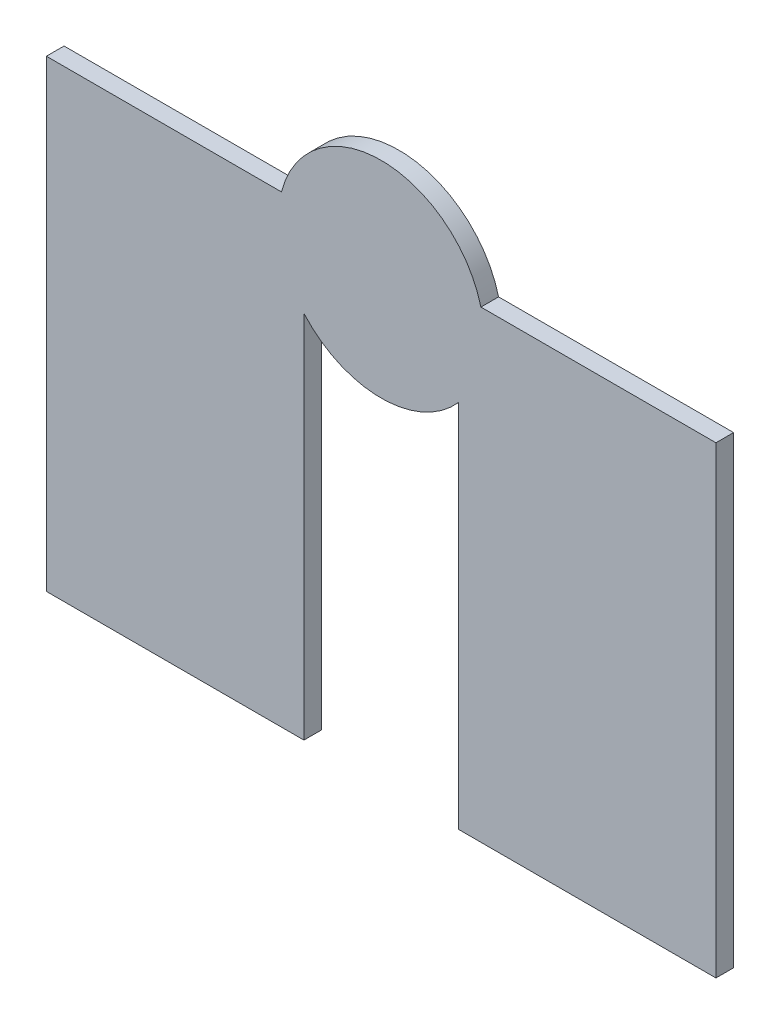
ISO-10303-21;
HEADER;
FILE_DESCRIPTION(('STEP AP214'),'2;1');
FILE_NAME('part.step','',(''),(''),'','','');
FILE_SCHEMA(('AUTOMOTIVE_DESIGN { 1 0 10303 214 1 1 1 1 }'));
ENDSEC;
DATA;
#1=APPLICATION_CONTEXT('core data for automotive mechanical design processes');
#2=APPLICATION_PROTOCOL_DEFINITION('international standard','automotive_design',2000,#1);
#3=PRODUCT_CONTEXT('',#1,'mechanical');
#4=PRODUCT('Part','Part','',(#3));
#5=PRODUCT_RELATED_PRODUCT_CATEGORY('part','',(#4));
#6=PRODUCT_DEFINITION_FORMATION('','',#4);
#7=PRODUCT_DEFINITION_CONTEXT('part definition',#1,'design');
#8=PRODUCT_DEFINITION('design','',#6,#7);
#9=PRODUCT_DEFINITION_SHAPE('','',#8);
#10=(LENGTH_UNIT() NAMED_UNIT(*) SI_UNIT(.MILLI.,.METRE.));
#11=(NAMED_UNIT(*) PLANE_ANGLE_UNIT() SI_UNIT($,.RADIAN.));
#12=(NAMED_UNIT(*) SI_UNIT($,.STERADIAN.) SOLID_ANGLE_UNIT());
#13=UNCERTAINTY_MEASURE_WITH_UNIT(LENGTH_MEASURE(1.E-05),#10,'distance_accuracy_value','');
#14=(GEOMETRIC_REPRESENTATION_CONTEXT(3) GLOBAL_UNCERTAINTY_ASSIGNED_CONTEXT((#13)) GLOBAL_UNIT_ASSIGNED_CONTEXT((#10,
#11,#12)) REPRESENTATION_CONTEXT('',''));
#15=CARTESIAN_POINT('',(0.,0.,0.));
#16=DIRECTION('',(0.,0.,1.));
#17=DIRECTION('',(1.,0.,0.));
#18=AXIS2_PLACEMENT_3D('',#15,#16,#17);
#19=CARTESIAN_POINT('',(9.400080000091,10.531653178882,0.));
#20=DIRECTION('',(0.,0.,-1.));
#21=DIRECTION('',(-1.,0.,0.));
#22=AXIS2_PLACEMENT_3D('',#19,#20,#21);
#23=PLANE('',#22);
#24=DIRECTION('',(1.,0.,0.));
#25=VECTOR('',#24,1.);
#26=CARTESIAN_POINT('',(9.593754639,10.95,0.));
#27=LINE('',#26,#25);
#28=CARTESIAN_POINT('',(9.59375463900021,10.95,0.));
#29=VERTEX_POINT('',#28);
#30=CARTESIAN_POINT('',(10.05008,10.95,0.));
#31=VERTEX_POINT('',#30);
#32=EDGE_CURVE('E64',#29,#31,#27,.T.);
#33=ORIENTED_EDGE('',*,*,#32,.T.);
#34=DIRECTION('',(0.,1.,0.));
#35=VECTOR('',#34,1.);
#36=CARTESIAN_POINT('',(10.05008,10.95,0.));
#37=LINE('',#36,#35);
#38=CARTESIAN_POINT('',(10.05008,10.05,0.));
#39=VERTEX_POINT('',#38);
#40=EDGE_CURVE('E84',#31,#39,#37,.F.);
#41=ORIENTED_EDGE('',*,*,#40,.T.);
#42=DIRECTION('',(1.,0.,0.));
#43=VECTOR('',#42,1.);
#44=CARTESIAN_POINT('',(10.05008,10.05,0.));
#45=LINE('',#44,#43);
#46=CARTESIAN_POINT('',(9.55008,10.05,0.));
#47=VERTEX_POINT('',#46);
#48=EDGE_CURVE('E79',#39,#47,#45,.F.);
#49=ORIENTED_EDGE('',*,*,#48,.T.);
#50=DIRECTION('',(0.,1.,0.));
#51=VECTOR('',#50,1.);
#52=CARTESIAN_POINT('',(9.55008,10.05,0.));
#53=LINE('',#52,#51);
#54=CARTESIAN_POINT('',(9.55008,10.7676751590001,0.));
#55=VERTEX_POINT('',#54);
#56=EDGE_CURVE('E83',#47,#55,#53,.T.);
#57=ORIENTED_EDGE('',*,*,#56,.T.);
#58=CARTESIAN_POINT('',(9.40008,10.900000014596,0.));
#59=DIRECTION('',(0.,0.,1.));
#60=DIRECTION('',(1.,0.,0.));
#61=AXIS2_PLACEMENT_3D('',#58,#59,#60);
#62=CIRCLE('',#61,0.200024667);
#63=CARTESIAN_POINT('',(9.25008000000004,10.7676751590001,0.));
#64=VERTEX_POINT('',#63);
#65=EDGE_CURVE('E96',#64,#55,#62,.T.);
#66=ORIENTED_EDGE('',*,*,#65,.F.);
#67=DIRECTION('',(0.,1.,0.));
#68=VECTOR('',#67,1.);
#69=CARTESIAN_POINT('',(9.25008,10.767675159,0.));
#70=LINE('',#69,#68);
#71=CARTESIAN_POINT('',(9.25008,10.05,0.));
#72=VERTEX_POINT('',#71);
#73=EDGE_CURVE('E109',#64,#72,#70,.F.);
#74=ORIENTED_EDGE('',*,*,#73,.T.);
#75=DIRECTION('',(1.,0.,0.));
#76=VECTOR('',#75,1.);
#77=CARTESIAN_POINT('',(9.25008,10.05,0.));
#78=LINE('',#77,#76);
#79=CARTESIAN_POINT('',(8.75008,10.05,0.));
#80=VERTEX_POINT('',#79);
#81=EDGE_CURVE('E116',#72,#80,#78,.F.);
#82=ORIENTED_EDGE('',*,*,#81,.T.);
#83=DIRECTION('',(0.,1.,0.));
#84=VECTOR('',#83,1.);
#85=CARTESIAN_POINT('',(8.75008,10.05,0.));
#86=LINE('',#85,#84);
#87=CARTESIAN_POINT('',(8.75008,10.95,0.));
#88=VERTEX_POINT('',#87);
#89=EDGE_CURVE('E122',#80,#88,#86,.T.);
#90=ORIENTED_EDGE('',*,*,#89,.T.);
#91=DIRECTION('',(1.,8.765680017843E-09,0.));
#92=VECTOR('',#91,1.);
#93=CARTESIAN_POINT('',(8.75008,10.95,0.));
#94=LINE('',#93,#92);
#95=CARTESIAN_POINT('',(9.20640536200022,10.950000004,0.));
#96=VERTEX_POINT('',#95);
#97=EDGE_CURVE('E128',#88,#96,#94,.T.);
#98=ORIENTED_EDGE('',*,*,#97,.T.);
#99=CARTESIAN_POINT('',(9.400079999984,10.899999983896,0.));
#100=DIRECTION('',(0.,0.,1.));
#101=DIRECTION('',(1.,0.,0.));
#102=AXIS2_PLACEMENT_3D('',#99,#100,#101);
#103=CIRCLE('',#102,0.200024667);
#104=EDGE_CURVE('E20',#29,#96,#103,.T.);
#105=ORIENTED_EDGE('',*,*,#104,.F.);
#106=EDGE_LOOP('',(#33,#41,#49,#57,#66,#74,#82,#90,#98,#105));
#107=FACE_BOUND('',#106,.T.);
#108=ADVANCED_FACE('F17',(#107),#23,.T.);
#109=CARTESIAN_POINT('',(10.05008,10.05,0.));
#110=DIRECTION('',(0.,1.,0.));
#111=DIRECTION('',(0.,0.,1.));
#112=AXIS2_PLACEMENT_3D('',#109,#110,#111);
#113=PLANE('',#112);
#114=DIRECTION('',(0.,0.,-1.));
#115=VECTOR('',#114,1.);
#116=CARTESIAN_POINT('',(9.55008,10.05,0.));
#117=LINE('',#116,#115);
#118=CARTESIAN_POINT('',(9.55008,10.05,0.03429));
#119=VERTEX_POINT('',#118);
#120=EDGE_CURVE('E91',#119,#47,#117,.T.);
#121=ORIENTED_EDGE('',*,*,#120,.T.);
#122=ORIENTED_EDGE('',*,*,#48,.F.);
#123=DIRECTION('',(0.,0.,1.));
#124=VECTOR('',#123,1.);
#125=CARTESIAN_POINT('',(10.05008,10.05,0.));
#126=LINE('',#125,#124);
#127=CARTESIAN_POINT('',(10.05008,10.05,0.03429));
#128=VERTEX_POINT('',#127);
#129=EDGE_CURVE('E134',#39,#128,#126,.T.);
#130=ORIENTED_EDGE('',*,*,#129,.T.);
#131=DIRECTION('',(1.,0.,0.));
#132=VECTOR('',#131,1.);
#133=CARTESIAN_POINT('',(9.400080000091,10.05,0.03429));
#134=LINE('',#133,#132);
#135=EDGE_CURVE('E94',#119,#128,#134,.T.);
#136=ORIENTED_EDGE('',*,*,#135,.F.);
#137=EDGE_LOOP('',(#121,#122,#130,#136));
#138=FACE_BOUND('',#137,.T.);
#139=ADVANCED_FACE('F92',(#138),#113,.F.);
#140=CARTESIAN_POINT('',(10.05008,10.95,0.));
#141=DIRECTION('',(-1.,0.,0.));
#142=DIRECTION('',(0.,0.,1.));
#143=AXIS2_PLACEMENT_3D('',#140,#141,#142);
#144=PLANE('',#143);
#145=ORIENTED_EDGE('',*,*,#129,.F.);
#146=ORIENTED_EDGE('',*,*,#40,.F.);
#147=DIRECTION('',(0.,0.,-1.));
#148=VECTOR('',#147,1.);
#149=CARTESIAN_POINT('',(10.05008,10.95,0.));
#150=LINE('',#149,#148);
#151=CARTESIAN_POINT('',(10.05008,10.95,0.03429));
#152=VERTEX_POINT('',#151);
#153=EDGE_CURVE('E133',#31,#152,#150,.F.);
#154=ORIENTED_EDGE('',*,*,#153,.T.);
#155=DIRECTION('',(0.,1.,0.));
#156=VECTOR('',#155,1.);
#157=CARTESIAN_POINT('',(10.05008,10.531653178882,0.03429));
#158=LINE('',#157,#156);
#159=EDGE_CURVE('E184',#128,#152,#158,.T.);
#160=ORIENTED_EDGE('',*,*,#159,.F.);
#161=EDGE_LOOP('',(#145,#146,#154,#160));
#162=FACE_BOUND('',#161,.T.);
#163=ADVANCED_FACE('F190',(#162),#144,.F.);
#164=CARTESIAN_POINT('',(9.593754639,10.95,0.));
#165=DIRECTION('',(0.,-1.,0.));
#166=DIRECTION('',(0.,0.,-1.));
#167=AXIS2_PLACEMENT_3D('',#164,#165,#166);
#168=PLANE('',#167);
#169=ORIENTED_EDGE('',*,*,#153,.F.);
#170=ORIENTED_EDGE('',*,*,#32,.F.);
#171=DIRECTION('',(0.,0.,1.));
#172=VECTOR('',#171,1.);
#173=CARTESIAN_POINT('',(9.5937546390002,10.9500000000001,0.));
#174=LINE('',#173,#172);
#175=CARTESIAN_POINT('',(9.59375463900021,10.95,0.03429));
#176=VERTEX_POINT('',#175);
#177=EDGE_CURVE('E177',#176,#29,#174,.F.);
#178=ORIENTED_EDGE('',*,*,#177,.F.);
#179=DIRECTION('',(1.,0.,0.));
#180=VECTOR('',#179,1.);
#181=CARTESIAN_POINT('',(9.400080000091,10.95,0.03429));
#182=LINE('',#181,#180);
#183=EDGE_CURVE('E146',#152,#176,#182,.F.);
#184=ORIENTED_EDGE('',*,*,#183,.F.);
#185=EDGE_LOOP('',(#169,#170,#178,#184));
#186=FACE_BOUND('',#185,.T.);
#187=ADVANCED_FACE('F241',(#186),#168,.F.);
#188=CARTESIAN_POINT('',(9.400079999984,10.899999983896,0.));
#189=DIRECTION('',(0.,0.,1.));
#190=DIRECTION('',(1.,0.,0.));
#191=AXIS2_PLACEMENT_3D('',#188,#189,#190);
#192=CYLINDRICAL_SURFACE('',#191,0.200024667);
#193=ORIENTED_EDGE('',*,*,#104,.T.);
#194=DIRECTION('',(0.,0.,1.));
#195=VECTOR('',#194,1.);
#196=CARTESIAN_POINT('',(9.206405362,10.950000004,0.));
#197=LINE('',#196,#195);
#198=CARTESIAN_POINT('',(9.20640536200022,10.950000004,0.03429));
#199=VERTEX_POINT('',#198);
#200=EDGE_CURVE('E125',#96,#199,#197,.T.);
#201=ORIENTED_EDGE('',*,*,#200,.T.);
#202=CARTESIAN_POINT('',(9.400079999984,10.899999983896,0.03429));
#203=DIRECTION('',(0.,0.,1.));
#204=DIRECTION('',(1.,0.,0.));
#205=AXIS2_PLACEMENT_3D('',#202,#203,#204);
#206=CIRCLE('',#205,0.200024667);
#207=EDGE_CURVE('E143',#176,#199,#206,.T.);
#208=ORIENTED_EDGE('',*,*,#207,.F.);
#209=ORIENTED_EDGE('',*,*,#177,.T.);
#210=EDGE_LOOP('',(#193,#201,#208,#209));
#211=FACE_BOUND('',#210,.T.);
#212=ADVANCED_FACE('F240',(#211),#192,.T.);
#213=CARTESIAN_POINT('',(8.75008,10.95,0.));
#214=DIRECTION('',(8.765680017843E-09,-1.,0.));
#215=DIRECTION('',(1.,8.765680017843E-09,0.));
#216=AXIS2_PLACEMENT_3D('',#213,#214,#215);
#217=PLANE('',#216);
#218=ORIENTED_EDGE('',*,*,#200,.F.);
#219=ORIENTED_EDGE('',*,*,#97,.F.);
#220=DIRECTION('',(0.,0.,-1.));
#221=VECTOR('',#220,1.);
#222=CARTESIAN_POINT('',(8.75008,10.95,0.));
#223=LINE('',#222,#221);
#224=CARTESIAN_POINT('',(8.75008,10.9500000026667,0.03429));
#225=VERTEX_POINT('',#224);
#226=EDGE_CURVE('E119',#88,#225,#223,.F.);
#227=ORIENTED_EDGE('',*,*,#226,.T.);
#228=DIRECTION('',(1.,0.,0.));
#229=VECTOR('',#228,1.);
#230=CARTESIAN_POINT('',(9.400080000091,10.950000004,0.03429));
#231=LINE('',#230,#229);
#232=EDGE_CURVE('E145',#199,#225,#231,.F.);
#233=ORIENTED_EDGE('',*,*,#232,.F.);
#234=EDGE_LOOP('',(#218,#219,#227,#233));
#235=FACE_BOUND('',#234,.T.);
#236=ADVANCED_FACE('F234',(#235),#217,.F.);
#237=CARTESIAN_POINT('',(8.75008,10.05,0.));
#238=DIRECTION('',(1.,0.,0.));
#239=DIRECTION('',(0.,0.,-1.));
#240=AXIS2_PLACEMENT_3D('',#237,#238,#239);
#241=PLANE('',#240);
#242=ORIENTED_EDGE('',*,*,#226,.F.);
#243=ORIENTED_EDGE('',*,*,#89,.F.);
#244=DIRECTION('',(0.,0.,1.));
#245=VECTOR('',#244,1.);
#246=CARTESIAN_POINT('',(8.75008,10.05,0.));
#247=LINE('',#246,#245);
#248=CARTESIAN_POINT('',(8.75008,10.05,0.03429));
#249=VERTEX_POINT('',#248);
#250=EDGE_CURVE('E113',#80,#249,#247,.T.);
#251=ORIENTED_EDGE('',*,*,#250,.T.);
#252=DIRECTION('',(0.,1.,0.));
#253=VECTOR('',#252,1.);
#254=CARTESIAN_POINT('',(8.75008,10.531653178882,0.03429));
#255=LINE('',#254,#253);
#256=EDGE_CURVE('E161',#225,#249,#255,.F.);
#257=ORIENTED_EDGE('',*,*,#256,.F.);
#258=EDGE_LOOP('',(#242,#243,#251,#257));
#259=FACE_BOUND('',#258,.T.);
#260=ADVANCED_FACE('F237',(#259),#241,.F.);
#261=CARTESIAN_POINT('',(9.25008,10.05,0.));
#262=DIRECTION('',(0.,1.,0.));
#263=DIRECTION('',(0.,0.,1.));
#264=AXIS2_PLACEMENT_3D('',#261,#262,#263);
#265=PLANE('',#264);
#266=ORIENTED_EDGE('',*,*,#250,.F.);
#267=ORIENTED_EDGE('',*,*,#81,.F.);
#268=DIRECTION('',(0.,0.,1.));
#269=VECTOR('',#268,1.);
#270=CARTESIAN_POINT('',(9.25008,10.05,0.));
#271=LINE('',#270,#269);
#272=CARTESIAN_POINT('',(9.25008,10.05,0.03429));
#273=VERTEX_POINT('',#272);
#274=EDGE_CURVE('E112',#72,#273,#271,.T.);
#275=ORIENTED_EDGE('',*,*,#274,.T.);
#276=DIRECTION('',(1.,0.,0.));
#277=VECTOR('',#276,1.);
#278=CARTESIAN_POINT('',(9.400080000091,10.05,0.03429));
#279=LINE('',#278,#277);
#280=EDGE_CURVE('E158',#249,#273,#279,.T.);
#281=ORIENTED_EDGE('',*,*,#280,.F.);
#282=EDGE_LOOP('',(#266,#267,#275,#281));
#283=FACE_BOUND('',#282,.T.);
#284=ADVANCED_FACE('F263',(#283),#265,.F.);
#285=CARTESIAN_POINT('',(9.25008,10.767675159,0.));
#286=DIRECTION('',(-1.,0.,0.));
#287=DIRECTION('',(0.,0.,1.));
#288=AXIS2_PLACEMENT_3D('',#285,#286,#287);
#289=PLANE('',#288);
#290=ORIENTED_EDGE('',*,*,#274,.F.);
#291=ORIENTED_EDGE('',*,*,#73,.F.);
#292=DIRECTION('',(0.,0.,1.));
#293=VECTOR('',#292,1.);
#294=CARTESIAN_POINT('',(9.25008000000008,10.7676751590001,0.));
#295=LINE('',#294,#293);
#296=CARTESIAN_POINT('',(9.25008000000004,10.7676751590001,0.03429));
#297=VERTEX_POINT('',#296);
#298=EDGE_CURVE('E147',#297,#64,#295,.F.);
#299=ORIENTED_EDGE('',*,*,#298,.F.);
#300=DIRECTION('',(0.,1.,0.));
#301=VECTOR('',#300,1.);
#302=CARTESIAN_POINT('',(9.25008,10.531653178882,0.03429));
#303=LINE('',#302,#301);
#304=EDGE_CURVE('E142',#273,#297,#303,.T.);
#305=ORIENTED_EDGE('',*,*,#304,.F.);
#306=EDGE_LOOP('',(#290,#291,#299,#305));
#307=FACE_BOUND('',#306,.T.);
#308=ADVANCED_FACE('F214',(#307),#289,.F.);
#309=CARTESIAN_POINT('',(9.40008,10.900000014596,0.));
#310=DIRECTION('',(0.,0.,1.));
#311=DIRECTION('',(1.,0.,0.));
#312=AXIS2_PLACEMENT_3D('',#309,#310,#311);
#313=CYLINDRICAL_SURFACE('',#312,0.200024667);
#314=ORIENTED_EDGE('',*,*,#65,.T.);
#315=DIRECTION('',(0.,0.,-1.));
#316=VECTOR('',#315,1.);
#317=CARTESIAN_POINT('',(9.55008,10.767675159,0.));
#318=LINE('',#317,#316);
#319=CARTESIAN_POINT('',(9.55008,10.7676751590001,0.03429));
#320=VERTEX_POINT('',#319);
#321=EDGE_CURVE('E35',#55,#320,#318,.F.);
#322=ORIENTED_EDGE('',*,*,#321,.T.);
#323=CARTESIAN_POINT('',(9.40008,10.900000014596,0.03429));
#324=DIRECTION('',(0.,0.,1.));
#325=DIRECTION('',(1.,0.,0.));
#326=AXIS2_PLACEMENT_3D('',#323,#324,#325);
#327=CIRCLE('',#326,0.200024667);
#328=EDGE_CURVE('E26',#297,#320,#327,.T.);
#329=ORIENTED_EDGE('',*,*,#328,.F.);
#330=ORIENTED_EDGE('',*,*,#298,.T.);
#331=EDGE_LOOP('',(#314,#322,#329,#330));
#332=FACE_BOUND('',#331,.T.);
#333=ADVANCED_FACE('F256',(#332),#313,.T.);
#334=CARTESIAN_POINT('',(9.55008,10.05,0.));
#335=DIRECTION('',(1.,0.,0.));
#336=DIRECTION('',(0.,0.,-1.));
#337=AXIS2_PLACEMENT_3D('',#334,#335,#336);
#338=PLANE('',#337);
#339=ORIENTED_EDGE('',*,*,#321,.F.);
#340=ORIENTED_EDGE('',*,*,#56,.F.);
#341=ORIENTED_EDGE('',*,*,#120,.F.);
#342=DIRECTION('',(0.,1.,0.));
#343=VECTOR('',#342,1.);
#344=CARTESIAN_POINT('',(9.55008,10.531653178882,0.03429));
#345=LINE('',#344,#343);
#346=EDGE_CURVE('E11',#320,#119,#345,.F.);
#347=ORIENTED_EDGE('',*,*,#346,.F.);
#348=EDGE_LOOP('',(#339,#340,#341,#347));
#349=FACE_BOUND('',#348,.T.);
#350=ADVANCED_FACE('F98',(#349),#338,.F.);
#351=CARTESIAN_POINT('',(9.400080000091,10.531653178882,0.03429));
#352=DIRECTION('',(0.,0.,1.));
#353=DIRECTION('',(1.,0.,0.));
#354=AXIS2_PLACEMENT_3D('',#351,#352,#353);
#355=PLANE('',#354);
#356=ORIENTED_EDGE('',*,*,#328,.T.);
#357=ORIENTED_EDGE('',*,*,#346,.T.);
#358=ORIENTED_EDGE('',*,*,#135,.T.);
#359=ORIENTED_EDGE('',*,*,#159,.T.);
#360=ORIENTED_EDGE('',*,*,#183,.T.);
#361=ORIENTED_EDGE('',*,*,#207,.T.);
#362=ORIENTED_EDGE('',*,*,#232,.T.);
#363=ORIENTED_EDGE('',*,*,#256,.T.);
#364=ORIENTED_EDGE('',*,*,#280,.T.);
#365=ORIENTED_EDGE('',*,*,#304,.T.);
#366=EDGE_LOOP('',(#356,#357,#358,#359,#360,#361,#362,#363,#364,#365));
#367=FACE_BOUND('',#366,.T.);
#368=ADVANCED_FACE('F194',(#367),#355,.T.);
#369=CLOSED_SHELL('',(#108,#139,#163,#187,#212,#236,#260,#284,#308,#333,#350,#368));
#370=MANIFOLD_SOLID_BREP('B1',#369);
#371=ADVANCED_BREP_SHAPE_REPRESENTATION('',(#18,#370),#14);
#372=SHAPE_DEFINITION_REPRESENTATION(#9,#371);
ENDSEC;
END-ISO-10303-21;
